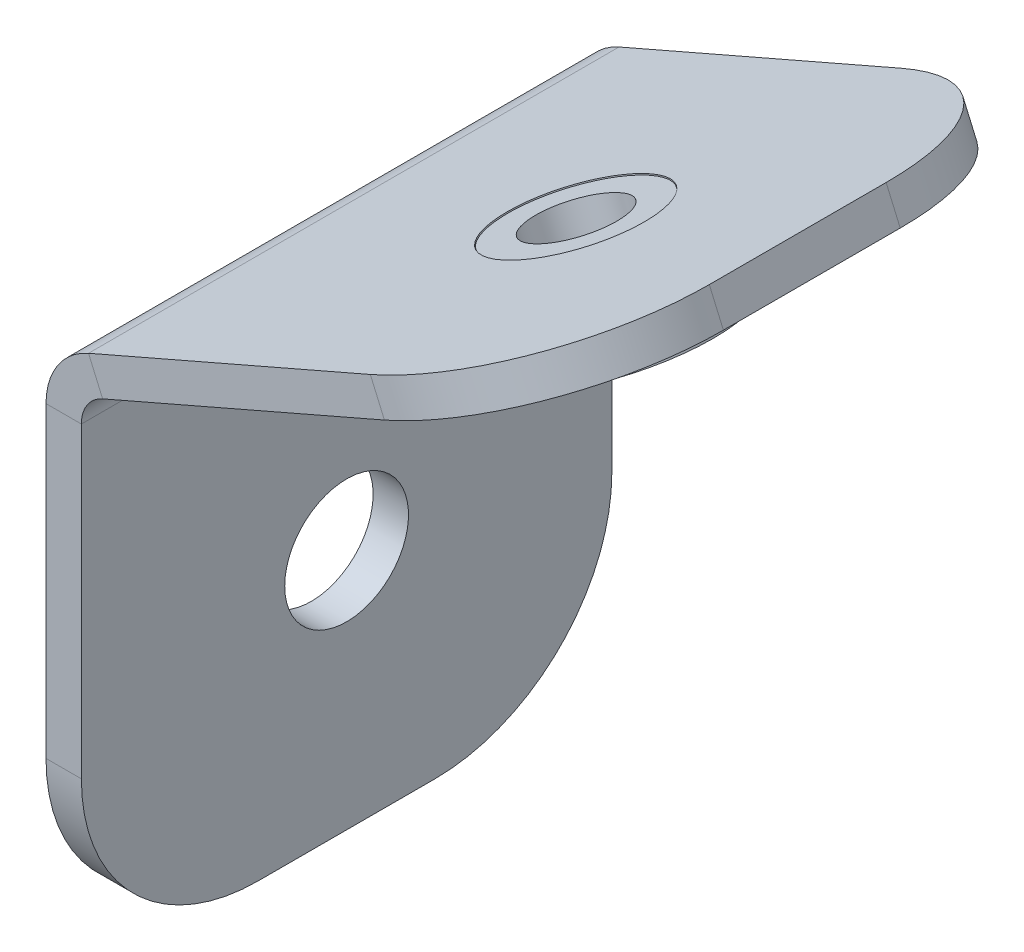
ISO-10303-21;
HEADER;
FILE_DESCRIPTION(('STEP AP214'),'2;1');
FILE_NAME('part.step','',(''),(''),'','','');
FILE_SCHEMA(('AUTOMOTIVE_DESIGN { 1 0 10303 214 1 1 1 1 }'));
ENDSEC;
DATA;
#1=APPLICATION_CONTEXT('core data for automotive mechanical design processes');
#2=APPLICATION_PROTOCOL_DEFINITION('international standard','automotive_design',2000,#1);
#3=PRODUCT_CONTEXT('',#1,'mechanical');
#4=PRODUCT('Part','Part','',(#3));
#5=PRODUCT_RELATED_PRODUCT_CATEGORY('part','',(#4));
#6=PRODUCT_DEFINITION_FORMATION('','',#4);
#7=PRODUCT_DEFINITION_CONTEXT('part definition',#1,'design');
#8=PRODUCT_DEFINITION('design','',#6,#7);
#9=PRODUCT_DEFINITION_SHAPE('','',#8);
#10=(LENGTH_UNIT() NAMED_UNIT(*) SI_UNIT(.MILLI.,.METRE.));
#11=(NAMED_UNIT(*) PLANE_ANGLE_UNIT() SI_UNIT($,.RADIAN.));
#12=(NAMED_UNIT(*) SI_UNIT($,.STERADIAN.) SOLID_ANGLE_UNIT());
#13=UNCERTAINTY_MEASURE_WITH_UNIT(LENGTH_MEASURE(1.E-05),#10,'distance_accuracy_value','');
#14=(GEOMETRIC_REPRESENTATION_CONTEXT(3) GLOBAL_UNCERTAINTY_ASSIGNED_CONTEXT((#13)) GLOBAL_UNIT_ASSIGNED_CONTEXT((#10,
#11,#12)) REPRESENTATION_CONTEXT('',''));
#15=CARTESIAN_POINT('',(0.,0.,0.));
#16=DIRECTION('',(0.,0.,1.));
#17=DIRECTION('',(1.,0.,0.));
#18=AXIS2_PLACEMENT_3D('',#15,#16,#17);
#19=CARTESIAN_POINT('',(8.4760741612763,15.9593991762646,7.5));
#20=DIRECTION('',(-0.398749068925244,0.917060074385125,0.));
#21=DIRECTION('',(-0.917060074385125,-0.398749068925244,0.));
#22=AXIS2_PLACEMENT_3D('',#19,#20,#21);
#23=PLANE('',#22);
#24=CARTESIAN_POINT('',(8.47607416127631,15.9593991762646,7.5));
#25=DIRECTION('',(0.398749068925244,-0.917060074385125,0.));
#26=DIRECTION('',(0.,0.,1.));
#27=AXIS2_PLACEMENT_3D('',#24,#25,#26);
#28=CIRCLE('',#27,1.24999999999999);
#29=CARTESIAN_POINT('',(8.47607416127631,15.9593991762646,8.74999999999999));
#30=VERTEX_POINT('',#29);
#31=EDGE_CURVE('E69',#30,#30,#28,.T.);
#32=ORIENTED_EDGE('',*,*,#31,.F.);
#33=EDGE_LOOP('',(#32));
#34=FACE_BOUND('',#33,.T.);
#35=CARTESIAN_POINT('',(8.4760741612763,15.9593991762646,7.5));
#36=DIRECTION('',(0.398749068925244,-0.917060074385125,0.));
#37=DIRECTION('',(0.917060074385125,0.398749068925244,0.));
#38=AXIS2_PLACEMENT_3D('',#35,#36,#37);
#39=CIRCLE('',#38,3.15);
#40=CARTESIAN_POINT('',(11.3648133955894,17.2154587433791,7.5));
#41=VERTEX_POINT('',#40);
#42=EDGE_CURVE('E11',#41,#41,#39,.T.);
#43=ORIENTED_EDGE('',*,*,#42,.T.);
#44=EDGE_LOOP('',(#43));
#45=FACE_BOUND('',#44,.T.);
#46=ADVANCED_FACE('F47',(#34,#45),#23,.F.);
#47=CARTESIAN_POINT('',(8.4760741612763,15.9593991762646,7.5));
#48=DIRECTION('',(0.398749068925244,-0.917060074385125,0.));
#49=DIRECTION('',(0.917060074385125,0.398749068925244,0.));
#50=AXIS2_PLACEMENT_3D('',#47,#48,#49);
#51=CYLINDRICAL_SURFACE('',#50,3.15);
#52=ORIENTED_EDGE('',*,*,#42,.F.);
#53=EDGE_LOOP('',(#52));
#54=FACE_BOUND('',#53,.T.);
#55=CARTESIAN_POINT('',(7.87795055788844,17.3349892878423,7.5));
#56=DIRECTION('',(0.398749068925244,-0.917060074385125,0.));
#57=DIRECTION('',(0.917060074385125,0.398749068925244,0.));
#58=AXIS2_PLACEMENT_3D('',#55,#56,#57);
#59=CIRCLE('',#58,3.15);
#60=CARTESIAN_POINT('',(10.7666897922016,18.5910488549568,7.5));
#61=VERTEX_POINT('',#60);
#62=EDGE_CURVE('E53',#61,#61,#59,.T.);
#63=ORIENTED_EDGE('',*,*,#62,.T.);
#64=EDGE_LOOP('',(#63));
#65=FACE_BOUND('',#64,.T.);
#66=ADVANCED_FACE('F77',(#54,#65),#51,.T.);
#67=CARTESIAN_POINT('',(4.9892113235753,16.0789297207278,7.5));
#68=DIRECTION('',(0.398749068925244,-0.917060074385125,0.));
#69=DIRECTION('',(0.917060074385125,0.398749068925244,0.));
#70=AXIS2_PLACEMENT_3D('',#67,#68,#69);
#71=PLANE('',#70);
#72=ORIENTED_EDGE('',*,*,#62,.F.);
#73=EDGE_LOOP('',(#72));
#74=FACE_BOUND('',#73,.T.);
#75=CARTESIAN_POINT('',(7.87795055788844,17.3349892878423,7.5));
#76=DIRECTION('',(0.398749068925244,-0.917060074385125,0.));
#77=DIRECTION('',(0.917060074385125,0.398749068925244,0.));
#78=AXIS2_PLACEMENT_3D('',#75,#76,#77);
#79=CIRCLE('',#78,2.1);
#80=CARTESIAN_POINT('',(9.8037767140972,18.1723623325853,7.5));
#81=VERTEX_POINT('',#80);
#82=EDGE_CURVE('E57',#81,#81,#79,.T.);
#83=ORIENTED_EDGE('',*,*,#82,.T.);
#84=EDGE_LOOP('',(#83));
#85=FACE_BOUND('',#84,.T.);
#86=ADVANCED_FACE('F81',(#74,#85),#71,.F.);
#87=CARTESIAN_POINT('',(8.4760741612763,15.9593991762646,7.5));
#88=DIRECTION('',(0.398749068925244,-0.917060074385125,0.));
#89=DIRECTION('',(0.917060074385125,0.398749068925244,0.));
#90=AXIS2_PLACEMENT_3D('',#87,#88,#89);
#91=CYLINDRICAL_SURFACE('',#90,2.1);
#92=ORIENTED_EDGE('',*,*,#82,.F.);
#93=EDGE_LOOP('',(#92));
#94=FACE_BOUND('',#93,.T.);
#95=CARTESIAN_POINT('',(7.49116396103095,18.2245375599959,7.5));
#96=DIRECTION('',(0.398749068925244,-0.917060074385125,0.));
#97=DIRECTION('',(0.917060074385125,0.398749068925244,0.));
#98=AXIS2_PLACEMENT_3D('',#95,#96,#97);
#99=CIRCLE('',#98,2.1);
#100=CARTESIAN_POINT('',(9.41699011723972,19.0619106047389,7.5));
#101=VERTEX_POINT('',#100);
#102=EDGE_CURVE('E61',#101,#101,#99,.T.);
#103=ORIENTED_EDGE('',*,*,#102,.T.);
#104=EDGE_LOOP('',(#103));
#105=FACE_BOUND('',#104,.T.);
#106=ADVANCED_FACE('F86',(#94,#105),#91,.T.);
#107=CARTESIAN_POINT('',(5.56533780482219,17.3871645152528,7.5));
#108=DIRECTION('',(0.398749068925244,-0.917060074385125,0.));
#109=DIRECTION('',(0.917060074385125,0.398749068925244,0.));
#110=AXIS2_PLACEMENT_3D('',#107,#108,#109);
#111=PLANE('',#110);
#112=CARTESIAN_POINT('',(7.49116396103095,18.2245375599959,7.5));
#113=DIRECTION('',(0.398749068925244,-0.917060074385125,0.));
#114=DIRECTION('',(0.917060074385125,0.398749068925244,0.));
#115=AXIS2_PLACEMENT_3D('',#112,#113,#114);
#116=CIRCLE('',#115,1.24999999999999);
#117=CARTESIAN_POINT('',(8.63748905401235,18.7229738961524,7.5));
#118=VERTEX_POINT('',#117);
#119=EDGE_CURVE('E66',#118,#118,#116,.T.);
#120=ORIENTED_EDGE('',*,*,#119,.T.);
#121=EDGE_LOOP('',(#120));
#122=FACE_BOUND('',#121,.T.);
#123=ORIENTED_EDGE('',*,*,#102,.F.);
#124=EDGE_LOOP('',(#123));
#125=FACE_BOUND('',#124,.T.);
#126=ADVANCED_FACE('F92',(#122,#125),#111,.F.);
#127=CARTESIAN_POINT('',(8.4760741612763,15.9593991762646,7.5));
#128=DIRECTION('',(0.398749068925244,-0.917060074385125,0.));
#129=DIRECTION('',(0.,0.,1.));
#130=AXIS2_PLACEMENT_3D('',#127,#128,#129);
#131=CYLINDRICAL_SURFACE('',#130,1.24999999999999);
#132=ORIENTED_EDGE('',*,*,#31,.T.);
#133=EDGE_LOOP('',(#132));
#134=FACE_BOUND('',#133,.T.);
#135=ORIENTED_EDGE('',*,*,#119,.F.);
#136=EDGE_LOOP('',(#135));
#137=FACE_BOUND('',#136,.T.);
#138=ADVANCED_FACE('F73',(#134,#137),#131,.F.);
#139=CLOSED_SHELL('',(#46,#66,#86,#106,#126,#138));
#140=MANIFOLD_SOLID_BREP('B2',#139);
#141=CARTESIAN_POINT('',(1.20250186214951,15.5228626905762,15.));
#142=DIRECTION('',(0.,0.,1.));
#143=DIRECTION('',(1.,0.,0.));
#144=AXIS2_PLACEMENT_3D('',#141,#142,#143);
#145=PLANE('',#144);
#146=DIRECTION('',(0.398749068925244,-0.917060074385125,0.));
#147=VECTOR('',#146,1.);
#148=CARTESIAN_POINT('',(1.20250186214951,15.5228626905762,15.));
#149=LINE('',#148,#147);
#150=CARTESIAN_POINT('',(1.20250186214951,15.5228626905762,15.));
#151=VERTEX_POINT('',#150);
#152=CARTESIAN_POINT('',(1.60125093107476,14.605802616191,15.));
#153=VERTEX_POINT('',#152);
#154=EDGE_CURVE('E233',#151,#153,#149,.T.);
#155=ORIENTED_EDGE('',*,*,#154,.F.);
#156=CARTESIAN_POINT('',(2.,13.6887425418059,15.));
#157=DIRECTION('',(0.,0.,1.));
#158=DIRECTION('',(1.,0.,0.));
#159=AXIS2_PLACEMENT_3D('',#156,#157,#158);
#160=CIRCLE('',#159,2.);
#161=CARTESIAN_POINT('',(0.,13.6887425418059,15.));
#162=VERTEX_POINT('',#161);
#163=EDGE_CURVE('E237',#162,#151,#160,.F.);
#164=ORIENTED_EDGE('',*,*,#163,.F.);
#165=DIRECTION('',(-1.,0.,0.));
#166=VECTOR('',#165,1.);
#167=CARTESIAN_POINT('',(1.,13.6887425418059,15.));
#168=LINE('',#167,#166);
#169=CARTESIAN_POINT('',(1.,13.6887425418059,15.));
#170=VERTEX_POINT('',#169);
#171=EDGE_CURVE('E242',#170,#162,#168,.T.);
#172=ORIENTED_EDGE('',*,*,#171,.F.);
#173=CARTESIAN_POINT('',(2.,13.6887425418059,15.));
#174=DIRECTION('',(0.,0.,1.));
#175=DIRECTION('',(1.,0.,0.));
#176=AXIS2_PLACEMENT_3D('',#173,#174,#175);
#177=CIRCLE('',#176,1.);
#178=EDGE_CURVE('E239',#170,#153,#177,.F.);
#179=ORIENTED_EDGE('',*,*,#178,.T.);
#180=EDGE_LOOP('',(#155,#164,#172,#179));
#181=FACE_BOUND('',#180,.T.);
#182=ADVANCED_FACE('F140',(#181),#145,.T.);
#183=CARTESIAN_POINT('',(1.,13.6887425418059,15.));
#184=DIRECTION('',(0.,0.,1.));
#185=DIRECTION('',(1.,0.,0.));
#186=AXIS2_PLACEMENT_3D('',#183,#184,#185);
#187=PLANE('',#186);
#188=DIRECTION('',(0.917060074385125,0.398749068925244,0.));
#189=VECTOR('',#188,1.);
#190=CARTESIAN_POINT('',(0.398749068925244,14.0829399256149,15.));
#191=LINE('',#190,#189);
#192=CARTESIAN_POINT('',(9.5693498127765,18.0704306148673,15.));
#193=VERTEX_POINT('',#192);
#194=EDGE_CURVE('E257',#153,#193,#191,.T.);
#195=ORIENTED_EDGE('',*,*,#194,.T.);
#196=DIRECTION('',(0.398749068925248,-0.917060074385123,0.));
#197=VECTOR('',#196,1.);
#198=CARTESIAN_POINT('',(9.80909806173298,17.5190473912918,15.));
#199=LINE('',#198,#197);
#200=CARTESIAN_POINT('',(9.17060074385125,18.9874906892524,15.));
#201=VERTEX_POINT('',#200);
#202=EDGE_CURVE('E163',#193,#201,#199,.F.);
#203=ORIENTED_EDGE('',*,*,#202,.T.);
#204=DIRECTION('',(0.917060074385125,0.398749068925244,0.));
#205=VECTOR('',#204,1.);
#206=CARTESIAN_POINT('',(0.,15.,15.));
#207=LINE('',#206,#205);
#208=EDGE_CURVE('E247',#151,#201,#207,.T.);
#209=ORIENTED_EDGE('',*,*,#208,.F.);
#210=ORIENTED_EDGE('',*,*,#154,.T.);
#211=EDGE_LOOP('',(#195,#203,#209,#210));
#212=FACE_BOUND('',#211,.T.);
#213=ADVANCED_FACE('F256',(#212),#187,.T.);
#214=CARTESIAN_POINT('',(0.,13.6887425418059,0.));
#215=DIRECTION('',(0.,0.,-1.));
#216=DIRECTION('',(-1.,0.,0.));
#217=AXIS2_PLACEMENT_3D('',#214,#215,#216);
#218=PLANE('',#217);
#219=DIRECTION('',(1.,0.,0.));
#220=VECTOR('',#219,1.);
#221=CARTESIAN_POINT('',(0.,13.6887425418059,0.));
#222=LINE('',#221,#220);
#223=CARTESIAN_POINT('',(0.,13.6887425418059,0.));
#224=VERTEX_POINT('',#223);
#225=CARTESIAN_POINT('',(1.,13.6887425418059,0.));
#226=VERTEX_POINT('',#225);
#227=EDGE_CURVE('E303',#224,#226,#222,.T.);
#228=ORIENTED_EDGE('',*,*,#227,.F.);
#229=CARTESIAN_POINT('',(2.,13.6887425418059,0.));
#230=DIRECTION('',(0.,0.,1.));
#231=DIRECTION('',(1.,0.,0.));
#232=AXIS2_PLACEMENT_3D('',#229,#230,#231);
#233=CIRCLE('',#232,2.);
#234=CARTESIAN_POINT('',(1.20250186214951,15.5228626905762,0.));
#235=VERTEX_POINT('',#234);
#236=EDGE_CURVE('E276',#224,#235,#233,.F.);
#237=ORIENTED_EDGE('',*,*,#236,.T.);
#238=DIRECTION('',(-0.398749068925244,0.917060074385125,0.));
#239=VECTOR('',#238,1.);
#240=CARTESIAN_POINT('',(1.60125093107476,14.605802616191,0.));
#241=LINE('',#240,#239);
#242=CARTESIAN_POINT('',(1.60125093107476,14.605802616191,0.));
#243=VERTEX_POINT('',#242);
#244=EDGE_CURVE('E301',#243,#235,#241,.T.);
#245=ORIENTED_EDGE('',*,*,#244,.F.);
#246=CARTESIAN_POINT('',(2.,13.6887425418059,0.));
#247=DIRECTION('',(0.,0.,1.));
#248=DIRECTION('',(1.,0.,0.));
#249=AXIS2_PLACEMENT_3D('',#246,#247,#248);
#250=CIRCLE('',#249,1.);
#251=EDGE_CURVE('E282',#226,#243,#250,.F.);
#252=ORIENTED_EDGE('',*,*,#251,.F.);
#253=EDGE_LOOP('',(#228,#237,#245,#252));
#254=FACE_BOUND('',#253,.T.);
#255=ADVANCED_FACE('F350',(#254),#218,.T.);
#256=CARTESIAN_POINT('',(1.60125093107476,14.605802616191,0.));
#257=DIRECTION('',(0.,0.,-1.));
#258=DIRECTION('',(-1.,0.,0.));
#259=AXIS2_PLACEMENT_3D('',#256,#257,#258);
#260=PLANE('',#259);
#261=DIRECTION('',(0.,1.,0.));
#262=VECTOR('',#261,1.);
#263=CARTESIAN_POINT('',(1.,0.,0.));
#264=LINE('',#263,#262);
#265=CARTESIAN_POINT('',(1.,5.,0.));
#266=VERTEX_POINT('',#265);
#267=EDGE_CURVE('E280',#266,#226,#264,.T.);
#268=ORIENTED_EDGE('',*,*,#267,.F.);
#269=DIRECTION('',(-1.,0.,0.));
#270=VECTOR('',#269,1.);
#271=CARTESIAN_POINT('',(1.60125093107476,5.,0.));
#272=LINE('',#271,#270);
#273=CARTESIAN_POINT('',(0.,5.,0.));
#274=VERTEX_POINT('',#273);
#275=EDGE_CURVE('E45',#266,#274,#272,.T.);
#276=ORIENTED_EDGE('',*,*,#275,.T.);
#277=DIRECTION('',(0.,1.,0.));
#278=VECTOR('',#277,1.);
#279=CARTESIAN_POINT('',(0.,0.,0.));
#280=LINE('',#279,#278);
#281=EDGE_CURVE('E278',#274,#224,#280,.T.);
#282=ORIENTED_EDGE('',*,*,#281,.T.);
#283=ORIENTED_EDGE('',*,*,#227,.T.);
#284=EDGE_LOOP('',(#268,#276,#282,#283));
#285=FACE_BOUND('',#284,.T.);
#286=ADVANCED_FACE('F367',(#285),#260,.T.);
#287=CARTESIAN_POINT('',(0.398749068925244,14.0829399256149,15.));
#288=DIRECTION('',(-0.398749068925244,0.917060074385125,0.));
#289=DIRECTION('',(-0.917060074385125,-0.398749068925244,0.));
#290=AXIS2_PLACEMENT_3D('',#287,#288,#289);
#291=PLANE('',#290);
#292=CARTESIAN_POINT('',(7.87795055788844,17.3349892878423,7.5));
#293=DIRECTION('',(-0.398749068925244,0.917060074385125,0.));
#294=DIRECTION('',(-0.917060074385125,-0.398749068925244,0.));
#295=AXIS2_PLACEMENT_3D('',#292,#293,#294);
#296=CIRCLE('',#295,2.11);
#297=CARTESIAN_POINT('',(5.94295380093583,16.49362875241,7.5));
#298=VERTEX_POINT('',#297);
#299=EDGE_CURVE('E274',#298,#298,#296,.F.);
#300=ORIENTED_EDGE('',*,*,#299,.F.);
#301=EDGE_LOOP('',(#300));
#302=FACE_BOUND('',#301,.T.);
#303=DIRECTION('',(0.,0.,-1.));
#304=VECTOR('',#303,1.);
#305=CARTESIAN_POINT('',(14.1546501847021,20.0641759594935,15.));
#306=LINE('',#305,#304);
#307=CARTESIAN_POINT('',(14.1546501847021,20.0641759594935,10.));
#308=VERTEX_POINT('',#307);
#309=CARTESIAN_POINT('',(14.1546501847021,20.0641759594935,5.));
#310=VERTEX_POINT('',#309);
#311=EDGE_CURVE('E298',#308,#310,#306,.T.);
#312=ORIENTED_EDGE('',*,*,#311,.F.);
#313=CARTESIAN_POINT('',(9.5693498127765,18.0704306148673,10.));
#314=DIRECTION('',(-0.398749068925244,0.917060074385125,0.));
#315=DIRECTION('',(-0.917060074385125,-0.398749068925244,0.));
#316=AXIS2_PLACEMENT_3D('',#313,#314,#315);
#317=CIRCLE('',#316,5.);
#318=EDGE_CURVE('E329',#308,#193,#317,.F.);
#319=ORIENTED_EDGE('',*,*,#318,.T.);
#320=ORIENTED_EDGE('',*,*,#194,.F.);
#321=DIRECTION('',(0.,0.,-1.));
#322=VECTOR('',#321,1.);
#323=CARTESIAN_POINT('',(1.60125093107476,14.605802616191,15.));
#324=LINE('',#323,#322);
#325=EDGE_CURVE('E270',#153,#243,#324,.T.);
#326=ORIENTED_EDGE('',*,*,#325,.T.);
#327=DIRECTION('',(0.917060074385125,0.398749068925244,0.));
#328=VECTOR('',#327,1.);
#329=CARTESIAN_POINT('',(0.398749068925244,14.0829399256149,0.));
#330=LINE('',#329,#328);
#331=CARTESIAN_POINT('',(9.5693498127765,18.0704306148673,0.));
#332=VERTEX_POINT('',#331);
#333=EDGE_CURVE('E271',#243,#332,#330,.T.);
#334=ORIENTED_EDGE('',*,*,#333,.T.);
#335=CARTESIAN_POINT('',(9.5693498127765,18.0704306148673,5.));
#336=DIRECTION('',(-0.398749068925244,0.917060074385125,0.));
#337=DIRECTION('',(-0.917060074385125,-0.398749068925244,0.));
#338=AXIS2_PLACEMENT_3D('',#335,#336,#337);
#339=CIRCLE('',#338,5.);
#340=EDGE_CURVE('E327',#332,#310,#339,.F.);
#341=ORIENTED_EDGE('',*,*,#340,.T.);
#342=EDGE_LOOP('',(#312,#319,#320,#326,#334,#341));
#343=FACE_BOUND('',#342,.T.);
#344=ADVANCED_FACE('F342',(#302,#343),#291,.F.);
#345=CARTESIAN_POINT('',(13.7559011157769,20.9812360338787,15.));
#346=DIRECTION('',(0.917060074385123,0.398749068925248,0.));
#347=DIRECTION('',(-0.398749068925248,0.917060074385123,0.));
#348=AXIS2_PLACEMENT_3D('',#345,#346,#347);
#349=PLANE('',#348);
#350=DIRECTION('',(0.,0.,-1.));
#351=VECTOR('',#350,1.);
#352=CARTESIAN_POINT('',(13.7559011157769,20.9812360338787,15.));
#353=LINE('',#352,#351);
#354=CARTESIAN_POINT('',(13.7559011157769,20.9812360338787,10.));
#355=VERTEX_POINT('',#354);
#356=CARTESIAN_POINT('',(13.7559011157769,20.9812360338787,5.));
#357=VERTEX_POINT('',#356);
#358=EDGE_CURVE('E253',#355,#357,#353,.T.);
#359=ORIENTED_EDGE('',*,*,#358,.F.);
#360=DIRECTION('',(0.398749068925248,-0.917060074385123,0.));
#361=VECTOR('',#360,1.);
#362=CARTESIAN_POINT('',(13.7559011157769,20.9812360338787,10.));
#363=LINE('',#362,#361);
#364=EDGE_CURVE('E324',#355,#308,#363,.T.);
#365=ORIENTED_EDGE('',*,*,#364,.T.);
#366=ORIENTED_EDGE('',*,*,#311,.T.);
#367=DIRECTION('',(0.398749068925248,-0.917060074385123,0.));
#368=VECTOR('',#367,1.);
#369=CARTESIAN_POINT('',(13.7559011157769,20.9812360338787,5.));
#370=LINE('',#369,#368);
#371=EDGE_CURVE('E322',#310,#357,#370,.F.);
#372=ORIENTED_EDGE('',*,*,#371,.T.);
#373=EDGE_LOOP('',(#359,#365,#366,#372));
#374=FACE_BOUND('',#373,.T.);
#375=ADVANCED_FACE('F403',(#374),#349,.T.);
#376=CARTESIAN_POINT('',(0.,15.,15.));
#377=DIRECTION('',(-0.398749068925244,0.917060074385125,0.));
#378=DIRECTION('',(-0.917060074385125,-0.398749068925244,0.));
#379=AXIS2_PLACEMENT_3D('',#376,#377,#378);
#380=PLANE('',#379);
#381=CARTESIAN_POINT('',(7.47920148896319,18.2520493622274,7.5));
#382=DIRECTION('',(-0.398749068925244,0.917060074385125,0.));
#383=DIRECTION('',(-0.917060074385125,-0.398749068925244,0.));
#384=AXIS2_PLACEMENT_3D('',#381,#382,#383);
#385=CIRCLE('',#384,2.11);
#386=CARTESIAN_POINT('',(5.54420473201058,17.4106888267952,7.5));
#387=VERTEX_POINT('',#386);
#388=EDGE_CURVE('E434',#387,#387,#385,.T.);
#389=ORIENTED_EDGE('',*,*,#388,.F.);
#390=EDGE_LOOP('',(#389));
#391=FACE_BOUND('',#390,.T.);
#392=ORIENTED_EDGE('',*,*,#208,.T.);
#393=CARTESIAN_POINT('',(9.17060074385125,18.9874906892524,10.));
#394=DIRECTION('',(-0.398749068925244,0.917060074385125,0.));
#395=DIRECTION('',(-0.917060074385125,-0.398749068925244,0.));
#396=AXIS2_PLACEMENT_3D('',#393,#394,#395);
#397=CIRCLE('',#396,5.);
#398=EDGE_CURVE('E333',#201,#355,#397,.T.);
#399=ORIENTED_EDGE('',*,*,#398,.T.);
#400=ORIENTED_EDGE('',*,*,#358,.T.);
#401=CARTESIAN_POINT('',(9.17060074385125,18.9874906892524,5.));
#402=DIRECTION('',(-0.398749068925244,0.917060074385125,0.));
#403=DIRECTION('',(-0.917060074385125,-0.398749068925244,0.));
#404=AXIS2_PLACEMENT_3D('',#401,#402,#403);
#405=CIRCLE('',#404,5.);
#406=CARTESIAN_POINT('',(9.17060074385125,18.9874906892524,0.));
#407=VERTEX_POINT('',#406);
#408=EDGE_CURVE('E155',#357,#407,#405,.T.);
#409=ORIENTED_EDGE('',*,*,#408,.T.);
#410=DIRECTION('',(0.917060074385125,0.398749068925244,0.));
#411=VECTOR('',#410,1.);
#412=CARTESIAN_POINT('',(0.,15.,0.));
#413=LINE('',#412,#411);
#414=EDGE_CURVE('E249',#235,#407,#413,.T.);
#415=ORIENTED_EDGE('',*,*,#414,.F.);
#416=DIRECTION('',(0.,0.,-1.));
#417=VECTOR('',#416,1.);
#418=CARTESIAN_POINT('',(1.20250186214951,15.5228626905762,15.));
#419=LINE('',#418,#417);
#420=EDGE_CURVE('E245',#151,#235,#419,.T.);
#421=ORIENTED_EDGE('',*,*,#420,.F.);
#422=EDGE_LOOP('',(#392,#399,#400,#409,#415,#421));
#423=FACE_BOUND('',#422,.T.);
#424=ADVANCED_FACE('F246',(#391,#423),#380,.T.);
#425=CARTESIAN_POINT('',(2.,13.6887425418059,15.));
#426=DIRECTION('',(0.,0.,-1.));
#427=DIRECTION('',(-1.,0.,0.));
#428=AXIS2_PLACEMENT_3D('',#425,#426,#427);
#429=CYLINDRICAL_SURFACE('',#428,2.);
#430=ORIENTED_EDGE('',*,*,#236,.F.);
#431=DIRECTION('',(0.,0.,-1.));
#432=VECTOR('',#431,1.);
#433=CARTESIAN_POINT('',(0.,13.6887425418059,15.));
#434=LINE('',#433,#432);
#435=EDGE_CURVE('E254',#162,#224,#434,.T.);
#436=ORIENTED_EDGE('',*,*,#435,.F.);
#437=ORIENTED_EDGE('',*,*,#163,.T.);
#438=ORIENTED_EDGE('',*,*,#420,.T.);
#439=EDGE_LOOP('',(#430,#436,#437,#438));
#440=FACE_BOUND('',#439,.T.);
#441=ADVANCED_FACE('F260',(#440),#429,.T.);
#442=CARTESIAN_POINT('',(0.,0.,15.));
#443=DIRECTION('',(-1.,0.,0.));
#444=DIRECTION('',(0.,0.,1.));
#445=AXIS2_PLACEMENT_3D('',#442,#443,#444);
#446=PLANE('',#445);
#447=CARTESIAN_POINT('',(0.,6.84437127090296,7.5));
#448=DIRECTION('',(-1.,0.,0.));
#449=DIRECTION('',(0.,0.,1.));
#450=AXIS2_PLACEMENT_3D('',#447,#448,#449);
#451=CIRCLE('',#450,1.75);
#452=CARTESIAN_POINT('',(0.,6.84437127090296,9.25));
#453=VERTEX_POINT('',#452);
#454=EDGE_CURVE('E594',#453,#453,#451,.T.);
#455=ORIENTED_EDGE('',*,*,#454,.F.);
#456=EDGE_LOOP('',(#455));
#457=FACE_BOUND('',#456,.T.);
#458=DIRECTION('',(0.,0.,-1.));
#459=VECTOR('',#458,1.);
#460=CARTESIAN_POINT('',(0.,0.,15.));
#461=LINE('',#460,#459);
#462=CARTESIAN_POINT('',(0.,0.,10.));
#463=VERTEX_POINT('',#462);
#464=CARTESIAN_POINT('',(0.,0.,5.));
#465=VERTEX_POINT('',#464);
#466=EDGE_CURVE('E293',#463,#465,#461,.T.);
#467=ORIENTED_EDGE('',*,*,#466,.F.);
#468=CARTESIAN_POINT('',(0.,5.,10.));
#469=DIRECTION('',(-1.,0.,0.));
#470=DIRECTION('',(0.,0.,1.));
#471=AXIS2_PLACEMENT_3D('',#468,#469,#470);
#472=CIRCLE('',#471,5.);
#473=CARTESIAN_POINT('',(0.,5.,15.));
#474=VERTEX_POINT('',#473);
#475=EDGE_CURVE('E314',#463,#474,#472,.T.);
#476=ORIENTED_EDGE('',*,*,#475,.T.);
#477=DIRECTION('',(0.,1.,0.));
#478=VECTOR('',#477,1.);
#479=CARTESIAN_POINT('',(0.,0.,15.));
#480=LINE('',#479,#478);
#481=EDGE_CURVE('E262',#474,#162,#480,.T.);
#482=ORIENTED_EDGE('',*,*,#481,.T.);
#483=ORIENTED_EDGE('',*,*,#435,.T.);
#484=ORIENTED_EDGE('',*,*,#281,.F.);
#485=CARTESIAN_POINT('',(0.,5.,5.));
#486=DIRECTION('',(-1.,0.,0.));
#487=DIRECTION('',(0.,0.,1.));
#488=AXIS2_PLACEMENT_3D('',#485,#486,#487);
#489=CIRCLE('',#488,5.);
#490=EDGE_CURVE('E312',#274,#465,#489,.T.);
#491=ORIENTED_EDGE('',*,*,#490,.T.);
#492=EDGE_LOOP('',(#467,#476,#482,#483,#484,#491));
#493=FACE_BOUND('',#492,.T.);
#494=ADVANCED_FACE('F356',(#457,#493),#446,.T.);
#495=CARTESIAN_POINT('',(1.,0.,15.));
#496=DIRECTION('',(0.,-1.,0.));
#497=DIRECTION('',(0.,0.,-1.));
#498=AXIS2_PLACEMENT_3D('',#495,#496,#497);
#499=PLANE('',#498);
#500=DIRECTION('',(0.,0.,-1.));
#501=VECTOR('',#500,1.);
#502=CARTESIAN_POINT('',(1.,0.,15.));
#503=LINE('',#502,#501);
#504=CARTESIAN_POINT('',(1.,0.,10.));
#505=VERTEX_POINT('',#504);
#506=CARTESIAN_POINT('',(1.,0.,5.));
#507=VERTEX_POINT('',#506);
#508=EDGE_CURVE('E290',#505,#507,#503,.T.);
#509=ORIENTED_EDGE('',*,*,#508,.F.);
#510=DIRECTION('',(-1.,0.,0.));
#511=VECTOR('',#510,1.);
#512=CARTESIAN_POINT('',(1.,0.,10.));
#513=LINE('',#512,#511);
#514=EDGE_CURVE('E309',#505,#463,#513,.T.);
#515=ORIENTED_EDGE('',*,*,#514,.T.);
#516=ORIENTED_EDGE('',*,*,#466,.T.);
#517=DIRECTION('',(-1.,0.,0.));
#518=VECTOR('',#517,1.);
#519=CARTESIAN_POINT('',(1.,0.,5.));
#520=LINE('',#519,#518);
#521=EDGE_CURVE('E241',#465,#507,#520,.F.);
#522=ORIENTED_EDGE('',*,*,#521,.T.);
#523=EDGE_LOOP('',(#509,#515,#516,#522));
#524=FACE_BOUND('',#523,.T.);
#525=ADVANCED_FACE('F372',(#524),#499,.T.);
#526=CARTESIAN_POINT('',(1.,0.,15.));
#527=DIRECTION('',(-1.,0.,0.));
#528=DIRECTION('',(0.,0.,1.));
#529=AXIS2_PLACEMENT_3D('',#526,#527,#528);
#530=PLANE('',#529);
#531=CARTESIAN_POINT('',(1.,6.84437127090296,7.5));
#532=DIRECTION('',(-1.,0.,0.));
#533=DIRECTION('',(0.,0.,1.));
#534=AXIS2_PLACEMENT_3D('',#531,#532,#533);
#535=CIRCLE('',#534,1.75);
#536=CARTESIAN_POINT('',(1.,6.84437127090296,9.25));
#537=VERTEX_POINT('',#536);
#538=EDGE_CURVE('E438',#537,#537,#535,.F.);
#539=ORIENTED_EDGE('',*,*,#538,.F.);
#540=EDGE_LOOP('',(#539));
#541=FACE_BOUND('',#540,.T.);
#542=DIRECTION('',(0.,1.,0.));
#543=VECTOR('',#542,1.);
#544=CARTESIAN_POINT('',(1.,0.,15.));
#545=LINE('',#544,#543);
#546=CARTESIAN_POINT('',(1.,5.,15.));
#547=VERTEX_POINT('',#546);
#548=EDGE_CURVE('E264',#547,#170,#545,.T.);
#549=ORIENTED_EDGE('',*,*,#548,.F.);
#550=CARTESIAN_POINT('',(1.,5.,10.));
#551=DIRECTION('',(-1.,0.,0.));
#552=DIRECTION('',(0.,0.,1.));
#553=AXIS2_PLACEMENT_3D('',#550,#551,#552);
#554=CIRCLE('',#553,5.);
#555=EDGE_CURVE('E320',#547,#505,#554,.F.);
#556=ORIENTED_EDGE('',*,*,#555,.T.);
#557=ORIENTED_EDGE('',*,*,#508,.T.);
#558=CARTESIAN_POINT('',(1.,5.,5.));
#559=DIRECTION('',(-1.,0.,0.));
#560=DIRECTION('',(0.,0.,1.));
#561=AXIS2_PLACEMENT_3D('',#558,#559,#560);
#562=CIRCLE('',#561,5.);
#563=EDGE_CURVE('E318',#507,#266,#562,.F.);
#564=ORIENTED_EDGE('',*,*,#563,.T.);
#565=ORIENTED_EDGE('',*,*,#267,.T.);
#566=DIRECTION('',(0.,0.,-1.));
#567=VECTOR('',#566,1.);
#568=CARTESIAN_POINT('',(1.,13.6887425418059,15.));
#569=LINE('',#568,#567);
#570=EDGE_CURVE('E287',#170,#226,#569,.T.);
#571=ORIENTED_EDGE('',*,*,#570,.F.);
#572=EDGE_LOOP('',(#549,#556,#557,#564,#565,#571));
#573=FACE_BOUND('',#572,.T.);
#574=ADVANCED_FACE('F363',(#541,#573),#530,.F.);
#575=CARTESIAN_POINT('',(2.,13.6887425418059,15.));
#576=DIRECTION('',(0.,0.,-1.));
#577=DIRECTION('',(-1.,0.,0.));
#578=AXIS2_PLACEMENT_3D('',#575,#576,#577);
#579=CYLINDRICAL_SURFACE('',#578,1.);
#580=ORIENTED_EDGE('',*,*,#251,.T.);
#581=ORIENTED_EDGE('',*,*,#325,.F.);
#582=ORIENTED_EDGE('',*,*,#178,.F.);
#583=ORIENTED_EDGE('',*,*,#570,.T.);
#584=EDGE_LOOP('',(#580,#581,#582,#583));
#585=FACE_BOUND('',#584,.T.);
#586=ADVANCED_FACE('F345',(#585),#579,.F.);
#587=CARTESIAN_POINT('',(2.,13.6887425418059,15.));
#588=DIRECTION('',(0.,0.,1.));
#589=DIRECTION('',(1.,0.,0.));
#590=AXIS2_PLACEMENT_3D('',#587,#588,#589);
#591=PLANE('',#590);
#592=ORIENTED_EDGE('',*,*,#481,.F.);
#593=DIRECTION('',(-1.,0.,0.));
#594=VECTOR('',#593,1.);
#595=CARTESIAN_POINT('',(2.,5.,15.));
#596=LINE('',#595,#594);
#597=EDGE_CURVE('E316',#474,#547,#596,.F.);
#598=ORIENTED_EDGE('',*,*,#597,.T.);
#599=ORIENTED_EDGE('',*,*,#548,.T.);
#600=ORIENTED_EDGE('',*,*,#171,.T.);
#601=EDGE_LOOP('',(#592,#598,#599,#600));
#602=FACE_BOUND('',#601,.T.);
#603=ADVANCED_FACE('F360',(#602),#591,.T.);
#604=CARTESIAN_POINT('',(2.,13.6887425418059,0.));
#605=DIRECTION('',(0.,0.,1.));
#606=DIRECTION('',(1.,0.,0.));
#607=AXIS2_PLACEMENT_3D('',#604,#605,#606);
#608=PLANE('',#607);
#609=ORIENTED_EDGE('',*,*,#414,.T.);
#610=DIRECTION('',(0.398749068925248,-0.917060074385124,0.));
#611=VECTOR('',#610,1.);
#612=CARTESIAN_POINT('',(9.5693498127765,18.0704306148673,0.));
#613=LINE('',#612,#611);
#614=EDGE_CURVE('E148',#407,#332,#613,.T.);
#615=ORIENTED_EDGE('',*,*,#614,.T.);
#616=ORIENTED_EDGE('',*,*,#333,.F.);
#617=ORIENTED_EDGE('',*,*,#244,.T.);
#618=EDGE_LOOP('',(#609,#615,#616,#617));
#619=FACE_BOUND('',#618,.T.);
#620=ADVANCED_FACE('F338',(#619),#608,.F.);
#621=CARTESIAN_POINT('',(15.2154799145162,0.459827081874642,7.5));
#622=DIRECTION('',(-0.398749068925244,0.917060074385125,0.));
#623=DIRECTION('',(-0.917060074385125,-0.398749068925244,0.));
#624=AXIS2_PLACEMENT_3D('',#621,#622,#623);
#625=CYLINDRICAL_SURFACE('',#624,2.11);
#626=ORIENTED_EDGE('',*,*,#388,.T.);
#627=EDGE_LOOP('',(#626));
#628=FACE_BOUND('',#627,.T.);
#629=ORIENTED_EDGE('',*,*,#299,.T.);
#630=EDGE_LOOP('',(#629));
#631=FACE_BOUND('',#630,.T.);
#632=ADVANCED_FACE('F387',(#628,#631),#625,.F.);
#633=CARTESIAN_POINT('',(14.1556501847021,6.84437127090296,7.5));
#634=DIRECTION('',(-1.,0.,0.));
#635=DIRECTION('',(0.,0.,1.));
#636=AXIS2_PLACEMENT_3D('',#633,#634,#635);
#637=CYLINDRICAL_SURFACE('',#636,1.75);
#638=ORIENTED_EDGE('',*,*,#454,.T.);
#639=EDGE_LOOP('',(#638));
#640=FACE_BOUND('',#639,.T.);
#641=ORIENTED_EDGE('',*,*,#538,.T.);
#642=EDGE_LOOP('',(#641));
#643=FACE_BOUND('',#642,.T.);
#644=ADVANCED_FACE('F378',(#640,#643),#637,.F.);
#645=CARTESIAN_POINT('',(1.,5.,10.));
#646=DIRECTION('',(-1.,0.,0.));
#647=DIRECTION('',(0.,0.,1.));
#648=AXIS2_PLACEMENT_3D('',#645,#646,#647);
#649=CYLINDRICAL_SURFACE('',#648,5.);
#650=ORIENTED_EDGE('',*,*,#555,.F.);
#651=ORIENTED_EDGE('',*,*,#597,.F.);
#652=ORIENTED_EDGE('',*,*,#475,.F.);
#653=ORIENTED_EDGE('',*,*,#514,.F.);
#654=EDGE_LOOP('',(#650,#651,#652,#653));
#655=FACE_BOUND('',#654,.T.);
#656=ADVANCED_FACE('F375',(#655),#649,.T.);
#657=CARTESIAN_POINT('',(9.17060074385126,18.9874906892524,10.));
#658=DIRECTION('',(0.398749068925248,-0.917060074385123,0.));
#659=DIRECTION('',(0.917060074385123,0.398749068925248,0.));
#660=AXIS2_PLACEMENT_3D('',#657,#658,#659);
#661=CYLINDRICAL_SURFACE('',#660,5.);
#662=ORIENTED_EDGE('',*,*,#398,.F.);
#663=ORIENTED_EDGE('',*,*,#202,.F.);
#664=ORIENTED_EDGE('',*,*,#318,.F.);
#665=ORIENTED_EDGE('',*,*,#364,.F.);
#666=EDGE_LOOP('',(#662,#663,#664,#665));
#667=FACE_BOUND('',#666,.T.);
#668=ADVANCED_FACE('F377',(#667),#661,.T.);
#669=CARTESIAN_POINT('',(9.96809888170173,17.1533705404822,5.));
#670=DIRECTION('',(-0.398749068925248,0.917060074385124,0.));
#671=DIRECTION('',(-0.917060074385124,-0.398749068925248,0.));
#672=AXIS2_PLACEMENT_3D('',#669,#670,#671);
#673=CYLINDRICAL_SURFACE('',#672,5.);
#674=ORIENTED_EDGE('',*,*,#408,.F.);
#675=ORIENTED_EDGE('',*,*,#371,.F.);
#676=ORIENTED_EDGE('',*,*,#340,.F.);
#677=ORIENTED_EDGE('',*,*,#614,.F.);
#678=EDGE_LOOP('',(#674,#675,#676,#677));
#679=FACE_BOUND('',#678,.T.);
#680=ADVANCED_FACE('F384',(#679),#673,.T.);
#681=CARTESIAN_POINT('',(1.60125093107476,5.,5.));
#682=DIRECTION('',(-1.,0.,0.));
#683=DIRECTION('',(0.,0.,1.));
#684=AXIS2_PLACEMENT_3D('',#681,#682,#683);
#685=CYLINDRICAL_SURFACE('',#684,5.);
#686=ORIENTED_EDGE('',*,*,#563,.F.);
#687=ORIENTED_EDGE('',*,*,#521,.F.);
#688=ORIENTED_EDGE('',*,*,#490,.F.);
#689=ORIENTED_EDGE('',*,*,#275,.F.);
#690=EDGE_LOOP('',(#686,#687,#688,#689));
#691=FACE_BOUND('',#690,.T.);
#692=ADVANCED_FACE('F142',(#691),#685,.T.);
#693=CLOSED_SHELL('',(#182,#213,#255,#286,#344,#375,#424,#441,#494,#525,#574,#586,#603,#620,
#632,#644,#656,#668,#680,#692));
#694=MANIFOLD_SOLID_BREP('B6',#693);
#695=ADVANCED_BREP_SHAPE_REPRESENTATION('',(#18,#140,#694),#14);
#696=SHAPE_DEFINITION_REPRESENTATION(#9,#695);
ENDSEC;
END-ISO-10303-21;
